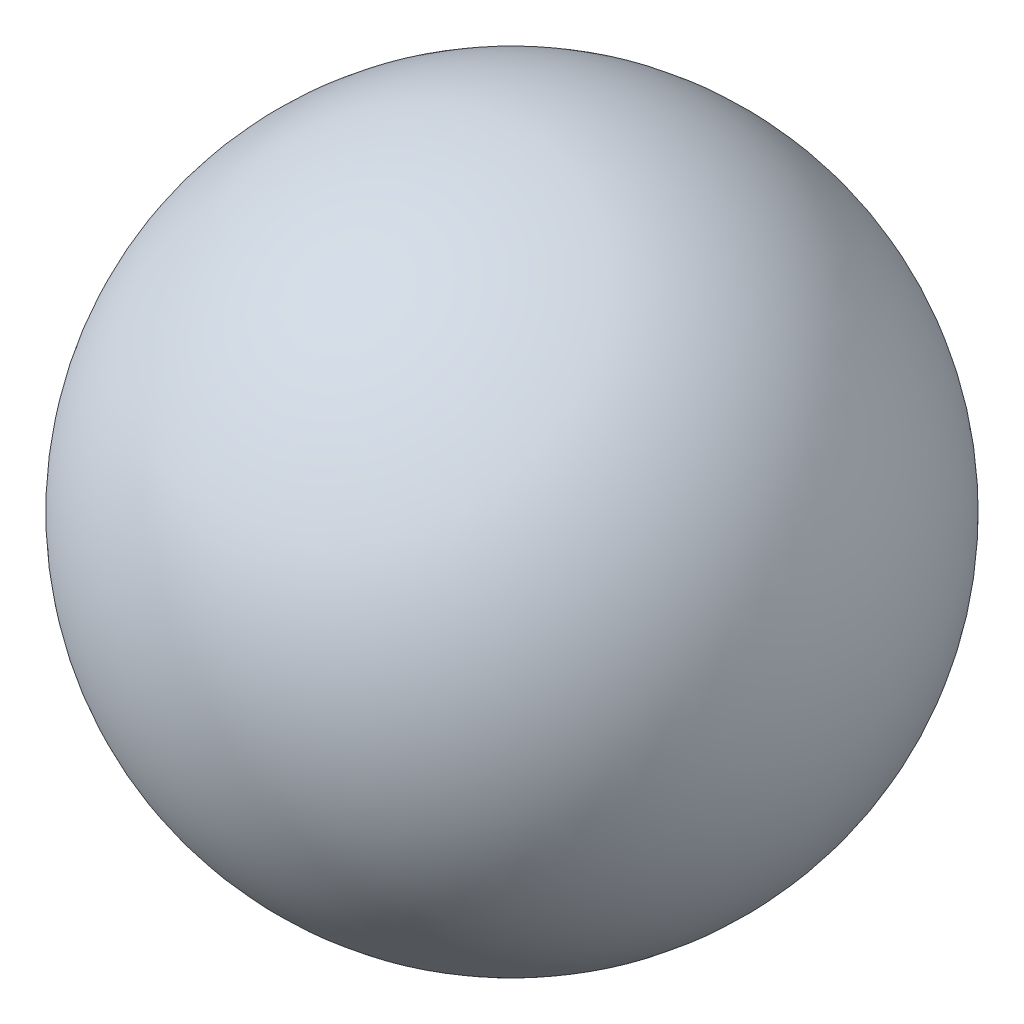
ISO-10303-21;
HEADER;
FILE_DESCRIPTION(('STEP AP214'),'2;1');
FILE_NAME('part.step','',(''),(''),'','','');
FILE_SCHEMA(('AUTOMOTIVE_DESIGN { 1 0 10303 214 1 1 1 1 }'));
ENDSEC;
DATA;
#1=APPLICATION_CONTEXT('core data for automotive mechanical design processes');
#2=APPLICATION_PROTOCOL_DEFINITION('international standard','automotive_design',2000,#1);
#3=PRODUCT_CONTEXT('',#1,'mechanical');
#4=PRODUCT('Part','Part','',(#3));
#5=PRODUCT_RELATED_PRODUCT_CATEGORY('part','',(#4));
#6=PRODUCT_DEFINITION_FORMATION('','',#4);
#7=PRODUCT_DEFINITION_CONTEXT('part definition',#1,'design');
#8=PRODUCT_DEFINITION('design','',#6,#7);
#9=PRODUCT_DEFINITION_SHAPE('','',#8);
#10=(LENGTH_UNIT() NAMED_UNIT(*) SI_UNIT(.MILLI.,.METRE.));
#11=(NAMED_UNIT(*) PLANE_ANGLE_UNIT() SI_UNIT($,.RADIAN.));
#12=(NAMED_UNIT(*) SI_UNIT($,.STERADIAN.) SOLID_ANGLE_UNIT());
#13=UNCERTAINTY_MEASURE_WITH_UNIT(LENGTH_MEASURE(1.E-05),#10,'distance_accuracy_value','');
#14=(GEOMETRIC_REPRESENTATION_CONTEXT(3) GLOBAL_UNCERTAINTY_ASSIGNED_CONTEXT((#13)) GLOBAL_UNIT_ASSIGNED_CONTEXT((#10,
#11,#12)) REPRESENTATION_CONTEXT('',''));
#15=CARTESIAN_POINT('',(0.,0.,0.));
#16=DIRECTION('',(0.,0.,1.));
#17=DIRECTION('',(1.,0.,0.));
#18=AXIS2_PLACEMENT_3D('',#15,#16,#17);
#19=CARTESIAN_POINT('',(0.,0.,0.));
#20=DIRECTION('',(0.,1.,0.));
#21=DIRECTION('',(0.,0.,-1.));
#22=AXIS2_PLACEMENT_3D('',#19,#20,#21);
#23=SPHERICAL_SURFACE('',#22,6.);
#24=CARTESIAN_POINT('',(0.,6.,0.));
#25=VERTEX_POINT('',#24);
#26=VERTEX_LOOP('',#25);
#27=FACE_BOUND('',#26,.T.);
#28=ADVANCED_FACE('F31',(#27),#23,.T.);
#29=CLOSED_SHELL('',(#28));
#30=CARTESIAN_POINT('',(-5.,0.,0.));
#31=DIRECTION('',(1.,0.,0.));
#32=DIRECTION('',(0.,0.,-1.));
#33=AXIS2_PLACEMENT_3D('',#30,#31,#32);
#34=CYLINDRICAL_SURFACE('',#33,1.5);
#35=CARTESIAN_POINT('',(0.,0.,0.));
#36=DIRECTION('',(0.707106781186547,-0.707106781186547,0.));
#37=DIRECTION('',(0.707106781186547,0.707106781186547,0.));
#38=AXIS2_PLACEMENT_3D('',#35,#36,#37);
#39=ELLIPSE('',#38,2.12132034355964,1.5);
#40=CARTESIAN_POINT('',(0.,0.,1.5));
#41=VERTEX_POINT('',#40);
#42=CARTESIAN_POINT('',(0.,0.,-1.5));
#43=VERTEX_POINT('',#42);
#44=EDGE_CURVE('E57',#41,#43,#39,.T.);
#45=ORIENTED_EDGE('',*,*,#44,.T.);
#46=CARTESIAN_POINT('',(0.,0.,0.));
#47=DIRECTION('',(0.707106781186547,0.707106781186547,0.));
#48=DIRECTION('',(0.707106781186547,-0.707106781186547,0.));
#49=AXIS2_PLACEMENT_3D('',#46,#47,#48);
#50=ELLIPSE('',#49,2.12132034355964,1.5);
#51=EDGE_CURVE('E62',#43,#41,#50,.T.);
#52=ORIENTED_EDGE('',*,*,#51,.T.);
#53=EDGE_LOOP('',(#45,#52));
#54=FACE_BOUND('',#53,.T.);
#55=CARTESIAN_POINT('',(-5.,0.,0.));
#56=DIRECTION('',(1.,0.,0.));
#57=DIRECTION('',(0.,0.,-1.));
#58=AXIS2_PLACEMENT_3D('',#55,#56,#57);
#59=CIRCLE('',#58,1.5);
#60=CARTESIAN_POINT('',(-5.,0.,-1.5));
#61=VERTEX_POINT('',#60);
#62=EDGE_CURVE('E11',#61,#61,#59,.T.);
#63=ORIENTED_EDGE('',*,*,#62,.F.);
#64=EDGE_LOOP('',(#63));
#65=FACE_BOUND('',#64,.T.);
#66=ADVANCED_FACE('F70',(#54,#65),#34,.F.);
#67=CARTESIAN_POINT('',(-5.,0.,0.));
#68=DIRECTION('',(1.,0.,0.));
#69=DIRECTION('',(0.,0.,-1.));
#70=AXIS2_PLACEMENT_3D('',#67,#68,#69);
#71=PLANE('',#70);
#72=ORIENTED_EDGE('',*,*,#62,.T.);
#73=EDGE_LOOP('',(#72));
#74=FACE_BOUND('',#73,.T.);
#75=ADVANCED_FACE('F114',(#74),#71,.T.);
#76=CARTESIAN_POINT('',(0.,5.,0.));
#77=DIRECTION('',(0.,1.,0.));
#78=DIRECTION('',(0.,0.,1.));
#79=AXIS2_PLACEMENT_3D('',#76,#77,#78);
#80=PLANE('',#79);
#81=CARTESIAN_POINT('',(0.,5.,0.));
#82=DIRECTION('',(0.,1.,0.));
#83=DIRECTION('',(0.,0.,1.));
#84=AXIS2_PLACEMENT_3D('',#81,#82,#83);
#85=CIRCLE('',#84,1.5);
#86=CARTESIAN_POINT('',(0.,5.,1.5));
#87=VERTEX_POINT('',#86);
#88=EDGE_CURVE('E240',#87,#87,#85,.T.);
#89=ORIENTED_EDGE('',*,*,#88,.F.);
#90=EDGE_LOOP('',(#89));
#91=FACE_BOUND('',#90,.T.);
#92=ADVANCED_FACE('F119',(#91),#80,.F.);
#93=CARTESIAN_POINT('',(0.,-5.,0.));
#94=DIRECTION('',(0.,1.,0.));
#95=DIRECTION('',(0.,0.,1.));
#96=AXIS2_PLACEMENT_3D('',#93,#94,#95);
#97=CYLINDRICAL_SURFACE('',#96,1.5);
#98=CARTESIAN_POINT('',(-1.4142135623731,2.5,-0.5));
#99=CARTESIAN_POINT('',(-1.41421347266367,2.52723408740534,-0.500000128973901));
#100=CARTESIAN_POINT('',(-1.41500884686403,2.55446739988576,-0.49776739184907));
#101=CARTESIAN_POINT('',(-1.4180878708729,2.60812721047531,-0.488925565851282));
#102=CARTESIAN_POINT('',(-1.4203717658361,2.63455357493197,-0.482315756085337));
#103=CARTESIAN_POINT('',(-1.42614101831944,2.68581344650641,-0.464977742840131));
#104=CARTESIAN_POINT('',(-1.4296240198232,2.71064996472344,-0.454257610701));
#105=CARTESIAN_POINT('',(-1.43739561008504,2.7581800242719,-0.429030814221313));
#106=CARTESIAN_POINT('',(-1.44168437652716,2.78087309127625,-0.414523314430261));
#107=CARTESIAN_POINT('',(-1.45077244702794,2.82435998116974,-0.381525573221263));
#108=CARTESIAN_POINT('',(-1.45558447422069,2.84505771433602,-0.362912170688912));
#109=CARTESIAN_POINT('',(-1.46506932400754,2.88310340061216,-0.322493833607244));
#110=CARTESIAN_POINT('',(-1.46974212414549,2.90045081579114,-0.3006883875262));
#111=CARTESIAN_POINT('',(-1.47856933460829,2.93173944866484,-0.253802253982491));
#112=CARTESIAN_POINT('',(-1.48270703850784,2.94557998530899,-0.228650955612258));
#113=CARTESIAN_POINT('',(-1.4898479338551,2.96879579256374,-0.17621561149374));
#114=CARTESIAN_POINT('',(-1.49285143101506,2.97817226658845,-0.148932142843606));
#115=CARTESIAN_POINT('',(-1.49729537715949,2.9918679273162,-0.0940144087167455));
#116=CARTESIAN_POINT('',(-1.49878657388779,2.9963517231285,-0.0664253774264829));
#117=CARTESIAN_POINT('',(-1.50021804109124,3.00065814668033,-0.0108489374120448));
#118=CARTESIAN_POINT('',(-1.50015871131445,3.00048197582621,0.0171383667719471));
#119=CARTESIAN_POINT('',(-1.49853019809368,2.99557787271698,0.0715517575969093));
#120=CARTESIAN_POINT('',(-1.49702032377569,2.99102873576275,0.0979960242958342));
#121=CARTESIAN_POINT('',(-1.49273483669855,2.97780350950977,0.149721719411081));
#122=CARTESIAN_POINT('',(-1.48995913815551,2.96912714051012,0.175003068889588));
#123=CARTESIAN_POINT('',(-1.48337835146652,2.94778934134693,0.224076237421007));
#124=CARTESIAN_POINT('',(-1.47956021262158,2.93507703072661,0.2478441104845));
#125=CARTESIAN_POINT('',(-1.47129196519309,2.90607014727581,0.292962162763585));
#126=CARTESIAN_POINT('',(-1.4668416810017,2.88977457833669,0.314311667192384));
#127=CARTESIAN_POINT('',(-1.45753095925538,2.85316280326962,0.355050433275955));
#128=CARTESIAN_POINT('',(-1.45266107586687,2.83269342107723,0.374300078533784));
#129=CARTESIAN_POINT('',(-1.44323667622202,2.78877563713872,0.40913862979794));
#130=CARTESIAN_POINT('',(-1.43868220864403,2.76532677714357,0.424726971636483));
#131=CARTESIAN_POINT('',(-1.43035262569106,2.7156731871921,0.451993727521386));
#132=CARTESIAN_POINT('',(-1.42658954674447,2.68943393431537,0.463613231825601));
#133=CARTESIAN_POINT('',(-1.42040825434116,2.6352143028676,0.482221596649677));
#134=CARTESIAN_POINT('',(-1.41798947731819,2.6072346593918,0.48921239787748));
#135=CARTESIAN_POINT('',(-1.41489818169014,2.55168082230333,0.498080641044514));
#136=CARTESIAN_POINT('',(-1.41415180223172,2.52414528763032,0.500174547752903));
#137=CARTESIAN_POINT('',(-1.41428336096614,2.4691119254414,0.499802719455807));
#138=CARTESIAN_POINT('',(-1.41516100413602,2.44161409198472,0.497337812612854));
#139=CARTESIAN_POINT('',(-1.41836809028099,2.38842151714123,0.488112825775626));
#140=CARTESIAN_POINT('',(-1.42064662715846,2.36269728492382,0.4815031969902));
#141=CARTESIAN_POINT('',(-1.42634276840086,2.31272819688116,0.464356931280375));
#142=CARTESIAN_POINT('',(-1.42976057468663,2.28848360420481,0.453819598181749));
#143=CARTESIAN_POINT('',(-1.4374843879661,2.24130978957629,0.428737170369428));
#144=CARTESIAN_POINT('',(-1.4418151283247,2.21844667867904,0.414075559179237));
#145=CARTESIAN_POINT('',(-1.45082884365827,2.1754269738082,0.38129281527879));
#146=CARTESIAN_POINT('',(-1.45551192221992,2.15527118066941,0.363170662749394));
#147=CARTESIAN_POINT('',(-1.46497519318826,2.11723600795466,0.322945852950159));
#148=CARTESIAN_POINT('',(-1.46974921788922,2.09951280499057,0.300693635273325));
#149=CARTESIAN_POINT('',(-1.47863425806581,2.06804192882598,0.253413645700129));
#150=CARTESIAN_POINT('',(-1.48274529708854,2.05429411441879,0.228385972432276));
#151=CARTESIAN_POINT('',(-1.48982202905295,2.03128994756914,0.176389931216147));
#152=CARTESIAN_POINT('',(-1.49279515002264,2.02200436142597,0.149435561660598));
#153=CARTESIAN_POINT('',(-1.49729305418889,2.00813612896995,0.094229232923008));
#154=CARTESIAN_POINT('',(-1.4988183601701,2.00355178505975,0.0659777459769445));
#155=CARTESIAN_POINT('',(-1.50020931618128,1.99936896119718,0.0104076679300201));
#156=CARTESIAN_POINT('',(-1.50014960044721,1.99954627303381,-0.0168923619600098));
#157=CARTESIAN_POINT('',(-1.49856098259698,2.0043286540732,-0.071055572500087));
#158=CARTESIAN_POINT('',(-1.49703219966784,2.00893336407638,-0.0979187884095278));
#159=CARTESIAN_POINT('',(-1.4927045747721,2.02229111728798,-0.15002105971603));
#160=CARTESIAN_POINT('',(-1.4899262918059,2.03097710767648,-0.175279135456398));
#161=CARTESIAN_POINT('',(-1.48338580352232,2.05218876554857,-0.223989175469895));
#162=CARTESIAN_POINT('',(-1.4796234202395,2.06471512759847,-0.247440812071205));
#163=CARTESIAN_POINT('',(-1.47132934414,2.09378475605104,-0.292817008154405));
#164=CARTESIAN_POINT('',(-1.46677436246191,2.11045934269096,-0.314653125778848));
#165=CARTESIAN_POINT('',(-1.45746494395712,2.14712869557796,-0.355290513136169));
#166=CARTESIAN_POINT('',(-1.45271044385698,2.16712452113084,-0.37409081081213));
#167=CARTESIAN_POINT('',(-1.44331639913682,2.21080467779402,-0.408870904416732));
#168=CARTESIAN_POINT('',(-1.43868863997672,2.23460275549038,-0.424711482999608));
#169=CARTESIAN_POINT('',(-1.43030096658152,2.28466721344933,-0.4521571716499));
#170=CARTESIAN_POINT('',(-1.42654082568085,2.31093294650712,-0.46376338840728));
#171=CARTESIAN_POINT('',(-1.42050667115267,2.36398091201192,-0.481921914103313));
#172=CARTESIAN_POINT('',(-1.418173164724,2.39068613178286,-0.488678954581634));
#173=CARTESIAN_POINT('',(-1.4150269180697,2.44492802525774,-0.497717160080847));
#174=CARTESIAN_POINT('',(-1.41421365307568,2.47246440871787,-0.499999869598251));
#175=CARTESIAN_POINT('',(-1.4142135623731,2.5,-0.5));
#176=B_SPLINE_CURVE_WITH_KNOTS('',3,(#98,#99,#100,#101,#102,#103,#104,#105,#106,#107,#108,#109,
#110,#111,#112,#113,#114,#115,#116,#117,#118,#119,#120,#121,#122,#123,#124,#125,#126,#127,#128,
#129,#130,#131,#132,#133,#134,#135,#136,#137,#138,#139,#140,#141,#142,#143,#144,#145,#146,#147,
#148,#149,#150,#151,#152,#153,#154,#155,#156,#157,#158,#159,#160,#161,#162,#163,#164,#165,#166,
#167,#168,#169,#170,#171,#172,#173,#174,#175),.UNSPECIFIED.,.T.,.F.,(4,2,2,2,2,2,2,2,2,2,2,2,2,
2,2,2,2,2,2,2,2,2,2,2,2,2,2,2,2,2,2,2,2,2,2,2,2,2,4),(0.,0.0816002923877087,0.16321402748444,
0.244668313727272,0.32614058306958,0.4105066871147,0.494886325836799,0.581467530695145,
0.668025381910804,0.75157159380153,0.835096266488495,0.915345024104704,0.995599220923042,
1.07690827427853,1.15823995934697,1.24340087179645,1.32857489803739,1.41496319918688,
1.50131525674844,1.58377145676863,1.66621267911373,1.74582197877144,1.82544539566229,
1.90759428860613,1.9897674282382,2.07589404078302,2.16201759371522,2.24756895588182,
2.33308941494834,2.41459042331574,2.49608481997646,2.57628478012971,2.65649925374377,
2.73967759753073,2.82288252209072,2.90934451360828,2.99578389126189,3.07831606073062,
3.16081973585834),.UNSPECIFIED.);
#177=CARTESIAN_POINT('',(-1.4142135623731,2.5,-0.5));
#178=VERTEX_POINT('',#177);
#179=EDGE_CURVE('E34',#178,#178,#176,.T.);
#180=ORIENTED_EDGE('',*,*,#179,.F.);
#181=EDGE_LOOP('',(#180));
#182=FACE_BOUND('',#181,.T.);
#183=ORIENTED_EDGE('',*,*,#88,.T.);
#184=EDGE_LOOP('',(#183));
#185=FACE_BOUND('',#184,.T.);
#186=CARTESIAN_POINT('',(1.4142135623731,2.5,-0.5));
#187=CARTESIAN_POINT('',(1.41421347266367,2.47276591259466,-0.500000128973901));
#188=CARTESIAN_POINT('',(1.41500884686403,2.44553260011424,-0.49776739184907));
#189=CARTESIAN_POINT('',(1.4180878708729,2.39187278952469,-0.488925565851282));
#190=CARTESIAN_POINT('',(1.4203717658361,2.36544642506803,-0.482315756085337));
#191=CARTESIAN_POINT('',(1.42614101831944,2.31418655349359,-0.464977742840131));
#192=CARTESIAN_POINT('',(1.4296240198232,2.28935003527656,-0.454257610701));
#193=CARTESIAN_POINT('',(1.43739561008504,2.2418199757281,-0.429030814221313));
#194=CARTESIAN_POINT('',(1.44168437652716,2.21912690872375,-0.414523314430261));
#195=CARTESIAN_POINT('',(1.45077244702794,2.17564001883026,-0.381525573221263));
#196=CARTESIAN_POINT('',(1.45558447422069,2.15494228566398,-0.362912170688912));
#197=CARTESIAN_POINT('',(1.46506932400754,2.11689659938784,-0.322493833607244));
#198=CARTESIAN_POINT('',(1.46974212414549,2.09954918420886,-0.3006883875262));
#199=CARTESIAN_POINT('',(1.47856933460829,2.06826055133516,-0.253802253982491));
#200=CARTESIAN_POINT('',(1.48270703850784,2.05442001469101,-0.228650955612258));
#201=CARTESIAN_POINT('',(1.4898479338551,2.03120420743626,-0.17621561149374));
#202=CARTESIAN_POINT('',(1.49285143101506,2.02182773341155,-0.148932142843606));
#203=CARTESIAN_POINT('',(1.49729537715949,2.0081320726838,-0.0940144087167455));
#204=CARTESIAN_POINT('',(1.49878657388779,2.0036482768715,-0.0664253774264829));
#205=CARTESIAN_POINT('',(1.50021804109124,1.99934185331967,-0.0108489374120448));
#206=CARTESIAN_POINT('',(1.50015871131445,1.99951802417379,0.0171383667719471));
#207=CARTESIAN_POINT('',(1.49853019809368,2.00442212728302,0.0715517575969093));
#208=CARTESIAN_POINT('',(1.49702032377569,2.00897126423725,0.0979960242958342));
#209=CARTESIAN_POINT('',(1.49273483669855,2.02219649049023,0.149721719411081));
#210=CARTESIAN_POINT('',(1.48995913815551,2.03087285948988,0.175003068889588));
#211=CARTESIAN_POINT('',(1.48337835146652,2.05221065865307,0.224076237421007));
#212=CARTESIAN_POINT('',(1.47956021262158,2.06492296927339,0.2478441104845));
#213=CARTESIAN_POINT('',(1.47129196519309,2.09392985272419,0.292962162763585));
#214=CARTESIAN_POINT('',(1.4668416810017,2.11022542166331,0.314311667192384));
#215=CARTESIAN_POINT('',(1.45753095925538,2.14683719673038,0.355050433275955));
#216=CARTESIAN_POINT('',(1.45266107586687,2.16730657892277,0.374300078533784));
#217=CARTESIAN_POINT('',(1.44323667622202,2.21122436286128,0.40913862979794));
#218=CARTESIAN_POINT('',(1.43868220864403,2.23467322285643,0.424726971636483));
#219=CARTESIAN_POINT('',(1.43035262569106,2.2843268128079,0.451993727521387));
#220=CARTESIAN_POINT('',(1.42658954674447,2.31056606568463,0.463613231825601));
#221=CARTESIAN_POINT('',(1.42040825434116,2.36478569713241,0.482221596649677));
#222=CARTESIAN_POINT('',(1.41798947731819,2.3927653406082,0.48921239787748));
#223=CARTESIAN_POINT('',(1.41489818169014,2.44831917769667,0.498080641044514));
#224=CARTESIAN_POINT('',(1.41415180223172,2.47585471236968,0.500174547752903));
#225=CARTESIAN_POINT('',(1.41428336096614,2.5308880745586,0.499802719455807));
#226=CARTESIAN_POINT('',(1.41516100413602,2.55838590801528,0.497337812612854));
#227=CARTESIAN_POINT('',(1.41836809028099,2.61157848285877,0.488112825775626));
#228=CARTESIAN_POINT('',(1.42064662715846,2.63730271507618,0.4815031969902));
#229=CARTESIAN_POINT('',(1.42634276840086,2.68727180311884,0.464356931280375));
#230=CARTESIAN_POINT('',(1.42976057468663,2.71151639579519,0.453819598181749));
#231=CARTESIAN_POINT('',(1.4374843879661,2.75869021042371,0.428737170369428));
#232=CARTESIAN_POINT('',(1.4418151283247,2.78155332132096,0.414075559179238));
#233=CARTESIAN_POINT('',(1.45082884365827,2.8245730261918,0.38129281527879));
#234=CARTESIAN_POINT('',(1.45551192221992,2.84472881933059,0.363170662749394));
#235=CARTESIAN_POINT('',(1.46497519318826,2.88276399204534,0.322945852950159));
#236=CARTESIAN_POINT('',(1.46974921788922,2.90048719500943,0.300693635273325));
#237=CARTESIAN_POINT('',(1.47863425806581,2.93195807117402,0.253413645700129));
#238=CARTESIAN_POINT('',(1.48274529708854,2.94570588558121,0.228385972432276));
#239=CARTESIAN_POINT('',(1.48982202905295,2.96871005243086,0.176389931216147));
#240=CARTESIAN_POINT('',(1.49279515002264,2.97799563857403,0.149435561660598));
#241=CARTESIAN_POINT('',(1.49729305418889,2.99186387103005,0.094229232923008));
#242=CARTESIAN_POINT('',(1.4988183601701,2.99644821494025,0.0659777459769445));
#243=CARTESIAN_POINT('',(1.50020931618128,3.00063103880282,0.0104076679300201));
#244=CARTESIAN_POINT('',(1.50014960044721,3.00045372696619,-0.0168923619600098));
#245=CARTESIAN_POINT('',(1.49856098259698,2.9956713459268,-0.071055572500087));
#246=CARTESIAN_POINT('',(1.49703219966784,2.99106663592362,-0.0979187884095278));
#247=CARTESIAN_POINT('',(1.4927045747721,2.97770888271202,-0.15002105971603));
#248=CARTESIAN_POINT('',(1.4899262918059,2.96902289232352,-0.175279135456398));
#249=CARTESIAN_POINT('',(1.48338580352232,2.94781123445143,-0.223989175469895));
#250=CARTESIAN_POINT('',(1.4796234202395,2.93528487240153,-0.247440812071205));
#251=CARTESIAN_POINT('',(1.47132934414,2.90621524394896,-0.292817008154404));
#252=CARTESIAN_POINT('',(1.46677436246191,2.88954065730904,-0.314653125778848));
#253=CARTESIAN_POINT('',(1.45746494395712,2.85287130442204,-0.355290513136169));
#254=CARTESIAN_POINT('',(1.45271044385699,2.83287547886916,-0.37409081081213));
#255=CARTESIAN_POINT('',(1.44331639913682,2.78919532220598,-0.408870904416732));
#256=CARTESIAN_POINT('',(1.43868863997672,2.76539724450962,-0.424711482999608));
#257=CARTESIAN_POINT('',(1.43030096658152,2.71533278655067,-0.4521571716499));
#258=CARTESIAN_POINT('',(1.42654082568085,2.68906705349288,-0.46376338840728));
#259=CARTESIAN_POINT('',(1.42050667115267,2.63601908798808,-0.481921914103313));
#260=CARTESIAN_POINT('',(1.418173164724,2.60931386821714,-0.488678954581634));
#261=CARTESIAN_POINT('',(1.4150269180697,2.55507197474226,-0.497717160080847));
#262=CARTESIAN_POINT('',(1.41421365307568,2.52753559128213,-0.499999869598251));
#263=CARTESIAN_POINT('',(1.4142135623731,2.5,-0.5));
#264=B_SPLINE_CURVE_WITH_KNOTS('',3,(#186,#187,#188,#189,#190,#191,#192,#193,#194,#195,#196,
#197,#198,#199,#200,#201,#202,#203,#204,#205,#206,#207,#208,#209,#210,#211,#212,#213,#214,#215,
#216,#217,#218,#219,#220,#221,#222,#223,#224,#225,#226,#227,#228,#229,#230,#231,#232,#233,#234,
#235,#236,#237,#238,#239,#240,#241,#242,#243,#244,#245,#246,#247,#248,#249,#250,#251,#252,#253,
#254,#255,#256,#257,#258,#259,#260,#261,#262,#263),.UNSPECIFIED.,.T.,.F.,(4,2,2,2,2,2,2,2,2,2,2,
2,2,2,2,2,2,2,2,2,2,2,2,2,2,2,2,2,2,2,2,2,2,2,2,2,2,2,4),(0.,0.0816002923877087,
0.16321402748444,0.244668313727272,0.32614058306958,0.4105066871147,0.494886325836799,
0.581467530695145,0.668025381910804,0.75157159380153,0.835096266488495,0.915345024104704,
0.995599220923042,1.07690827427853,1.15823995934697,1.24340087179645,1.32857489803739,
1.41496319918688,1.50131525674844,1.58377145676863,1.66621267911373,1.74582197877144,
1.82544539566229,1.90759428860613,1.9897674282382,2.07589404078302,2.16201759371522,
2.24756895588182,2.33308941494834,2.41459042331574,2.49608481997646,2.57628478012971,
2.65649925374377,2.73967759753073,2.82288252209072,2.90934451360828,2.99578389126189,
3.07831606073062,3.16081973585834),.UNSPECIFIED.);
#265=CARTESIAN_POINT('',(1.4142135623731,2.5,-0.5));
#266=VERTEX_POINT('',#265);
#267=EDGE_CURVE('E80',#266,#266,#264,.T.);
#268=ORIENTED_EDGE('',*,*,#267,.F.);
#269=EDGE_LOOP('',(#268));
#270=FACE_BOUND('',#269,.T.);
#271=CARTESIAN_POINT('',(0.,0.,0.));
#272=DIRECTION('',(0.707106781186547,-0.707106781186547,0.));
#273=DIRECTION('',(0.707106781186547,0.707106781186547,0.));
#274=AXIS2_PLACEMENT_3D('',#271,#272,#273);
#275=ELLIPSE('',#274,2.12132034355964,1.5);
#276=EDGE_CURVE('E51',#41,#43,#275,.F.);
#277=ORIENTED_EDGE('',*,*,#276,.F.);
#278=ORIENTED_EDGE('',*,*,#51,.F.);
#279=EDGE_LOOP('',(#277,#278));
#280=FACE_BOUND('',#279,.T.);
#281=ADVANCED_FACE('F65',(#182,#185,#270,#280),#97,.F.);
#282=CARTESIAN_POINT('',(-5.,2.5,0.));
#283=DIRECTION('',(1.,0.,0.));
#284=DIRECTION('',(0.,0.,-1.));
#285=AXIS2_PLACEMENT_3D('',#282,#283,#284);
#286=CYLINDRICAL_SURFACE('',#285,0.5);
#287=ORIENTED_EDGE('',*,*,#179,.T.);
#288=EDGE_LOOP('',(#287));
#289=FACE_BOUND('',#288,.T.);
#290=CARTESIAN_POINT('',(-5.,2.5,0.));
#291=DIRECTION('',(1.,0.,0.));
#292=DIRECTION('',(0.,0.,-1.));
#293=AXIS2_PLACEMENT_3D('',#290,#291,#292);
#294=CIRCLE('',#293,0.5);
#295=CARTESIAN_POINT('',(-5.,2.5,-0.5));
#296=VERTEX_POINT('',#295);
#297=EDGE_CURVE('E76',#296,#296,#294,.T.);
#298=ORIENTED_EDGE('',*,*,#297,.F.);
#299=EDGE_LOOP('',(#298));
#300=FACE_BOUND('',#299,.T.);
#301=ADVANCED_FACE('F104',(#289,#300),#286,.F.);
#302=CARTESIAN_POINT('',(-5.,2.5,0.));
#303=DIRECTION('',(1.,0.,0.));
#304=DIRECTION('',(0.,0.,-1.));
#305=AXIS2_PLACEMENT_3D('',#302,#303,#304);
#306=PLANE('',#305);
#307=ORIENTED_EDGE('',*,*,#297,.T.);
#308=EDGE_LOOP('',(#307));
#309=FACE_BOUND('',#308,.T.);
#310=ADVANCED_FACE('F101',(#309),#306,.T.);
#311=CARTESIAN_POINT('',(5.,0.,0.));
#312=DIRECTION('',(1.,0.,0.));
#313=DIRECTION('',(0.,0.,-1.));
#314=AXIS2_PLACEMENT_3D('',#311,#312,#313);
#315=PLANE('',#314);
#316=CARTESIAN_POINT('',(5.,0.,0.));
#317=DIRECTION('',(1.,0.,0.));
#318=DIRECTION('',(0.,0.,-1.));
#319=AXIS2_PLACEMENT_3D('',#316,#317,#318);
#320=CIRCLE('',#319,1.5);
#321=CARTESIAN_POINT('',(5.,0.,-1.5));
#322=VERTEX_POINT('',#321);
#323=EDGE_CURVE('E44',#322,#322,#320,.T.);
#324=ORIENTED_EDGE('',*,*,#323,.F.);
#325=EDGE_LOOP('',(#324));
#326=FACE_BOUND('',#325,.T.);
#327=ADVANCED_FACE('F103',(#326),#315,.F.);
#328=ORIENTED_EDGE('',*,*,#323,.T.);
#329=EDGE_LOOP('',(#328));
#330=FACE_BOUND('',#329,.T.);
#331=ORIENTED_EDGE('',*,*,#276,.T.);
#332=CARTESIAN_POINT('',(0.,0.,0.));
#333=DIRECTION('',(0.707106781186547,0.707106781186547,0.));
#334=DIRECTION('',(0.707106781186547,-0.707106781186547,0.));
#335=AXIS2_PLACEMENT_3D('',#332,#333,#334);
#336=ELLIPSE('',#335,2.12132034355964,1.5);
#337=EDGE_CURVE('E59',#43,#41,#336,.F.);
#338=ORIENTED_EDGE('',*,*,#337,.T.);
#339=EDGE_LOOP('',(#331,#338));
#340=FACE_BOUND('',#339,.T.);
#341=ADVANCED_FACE('F67',(#330,#340),#34,.F.);
#342=CARTESIAN_POINT('',(0.,-5.,0.));
#343=DIRECTION('',(0.,1.,0.));
#344=DIRECTION('',(0.,0.,1.));
#345=AXIS2_PLACEMENT_3D('',#342,#343,#344);
#346=CIRCLE('',#345,1.5);
#347=CARTESIAN_POINT('',(0.,-5.,1.5));
#348=VERTEX_POINT('',#347);
#349=EDGE_CURVE('E84',#348,#348,#346,.T.);
#350=ORIENTED_EDGE('',*,*,#349,.F.);
#351=EDGE_LOOP('',(#350));
#352=FACE_BOUND('',#351,.T.);
#353=ORIENTED_EDGE('',*,*,#44,.F.);
#354=ORIENTED_EDGE('',*,*,#337,.F.);
#355=EDGE_LOOP('',(#353,#354));
#356=FACE_BOUND('',#355,.T.);
#357=ADVANCED_FACE('F58',(#352,#356),#97,.F.);
#358=CARTESIAN_POINT('',(0.,-5.,0.));
#359=DIRECTION('',(0.,1.,0.));
#360=DIRECTION('',(0.,0.,1.));
#361=AXIS2_PLACEMENT_3D('',#358,#359,#360);
#362=PLANE('',#361);
#363=ORIENTED_EDGE('',*,*,#349,.T.);
#364=EDGE_LOOP('',(#363));
#365=FACE_BOUND('',#364,.T.);
#366=ADVANCED_FACE('F93',(#365),#362,.T.);
#367=CARTESIAN_POINT('',(5.,2.5,0.));
#368=DIRECTION('',(1.,0.,0.));
#369=DIRECTION('',(0.,0.,-1.));
#370=AXIS2_PLACEMENT_3D('',#367,#368,#369);
#371=PLANE('',#370);
#372=CARTESIAN_POINT('',(5.,2.5,0.));
#373=DIRECTION('',(1.,0.,0.));
#374=DIRECTION('',(0.,0.,-1.));
#375=AXIS2_PLACEMENT_3D('',#372,#373,#374);
#376=CIRCLE('',#375,0.5);
#377=CARTESIAN_POINT('',(5.,2.5,-0.5));
#378=VERTEX_POINT('',#377);
#379=EDGE_CURVE('E68',#378,#378,#376,.T.);
#380=ORIENTED_EDGE('',*,*,#379,.F.);
#381=EDGE_LOOP('',(#380));
#382=FACE_BOUND('',#381,.T.);
#383=ADVANCED_FACE('F97',(#382),#371,.F.);
#384=ORIENTED_EDGE('',*,*,#267,.T.);
#385=EDGE_LOOP('',(#384));
#386=FACE_BOUND('',#385,.T.);
#387=ORIENTED_EDGE('',*,*,#379,.T.);
#388=EDGE_LOOP('',(#387));
#389=FACE_BOUND('',#388,.T.);
#390=ADVANCED_FACE('F85',(#386,#389),#286,.F.);
#391=CLOSED_SHELL('',(#66,#75,#92,#281,#301,#310,#327,#341,#357,#366,#383,#390));
#392=CARTESIAN_POINT('',(0.,-5.,-2.5));
#393=DIRECTION('',(0.,1.,0.));
#394=DIRECTION('',(0.,0.,1.));
#395=AXIS2_PLACEMENT_3D('',#392,#393,#394);
#396=CYLINDRICAL_SURFACE('',#395,0.5);
#397=CARTESIAN_POINT('',(0.,-5.,-2.5));
#398=DIRECTION('',(0.,1.,0.));
#399=DIRECTION('',(0.,0.,1.));
#400=AXIS2_PLACEMENT_3D('',#397,#398,#399);
#401=CIRCLE('',#400,0.5);
#402=CARTESIAN_POINT('',(0.,-5.,-2.));
#403=VERTEX_POINT('',#402);
#404=EDGE_CURVE('E242',#403,#403,#401,.T.);
#405=ORIENTED_EDGE('',*,*,#404,.F.);
#406=EDGE_LOOP('',(#405));
#407=FACE_BOUND('',#406,.T.);
#408=CARTESIAN_POINT('',(0.,5.,-2.5));
#409=DIRECTION('',(0.,1.,0.));
#410=DIRECTION('',(0.,0.,1.));
#411=AXIS2_PLACEMENT_3D('',#408,#409,#410);
#412=CIRCLE('',#411,0.5);
#413=CARTESIAN_POINT('',(0.,5.,-2.));
#414=VERTEX_POINT('',#413);
#415=EDGE_CURVE('E247',#414,#414,#412,.T.);
#416=ORIENTED_EDGE('',*,*,#415,.T.);
#417=EDGE_LOOP('',(#416));
#418=FACE_BOUND('',#417,.T.);
#419=ADVANCED_FACE('F154',(#407,#418),#396,.F.);
#420=CARTESIAN_POINT('',(0.,-5.,-2.5));
#421=DIRECTION('',(0.,1.,0.));
#422=DIRECTION('',(0.,0.,1.));
#423=AXIS2_PLACEMENT_3D('',#420,#421,#422);
#424=PLANE('',#423);
#425=ORIENTED_EDGE('',*,*,#404,.T.);
#426=EDGE_LOOP('',(#425));
#427=FACE_BOUND('',#426,.T.);
#428=ADVANCED_FACE('F157',(#427),#424,.T.);
#429=CARTESIAN_POINT('',(0.,5.,-2.5));
#430=DIRECTION('',(0.,1.,0.));
#431=DIRECTION('',(0.,0.,1.));
#432=AXIS2_PLACEMENT_3D('',#429,#430,#431);
#433=PLANE('',#432);
#434=ORIENTED_EDGE('',*,*,#415,.F.);
#435=EDGE_LOOP('',(#434));
#436=FACE_BOUND('',#435,.T.);
#437=ADVANCED_FACE('F166',(#436),#433,.F.);
#438=CLOSED_SHELL('',(#419,#428,#437));
#439=ORIENTED_CLOSED_SHELL('',*,#29,.T.);
#440=ORIENTED_CLOSED_SHELL('',*,#438,.T.);
#441=BREP_WITH_VOIDS('B2',#391,(#439,#440));
#442=ADVANCED_BREP_SHAPE_REPRESENTATION('',(#18,#441),#14);
#443=SHAPE_DEFINITION_REPRESENTATION(#9,#442);
ENDSEC;
END-ISO-10303-21;
